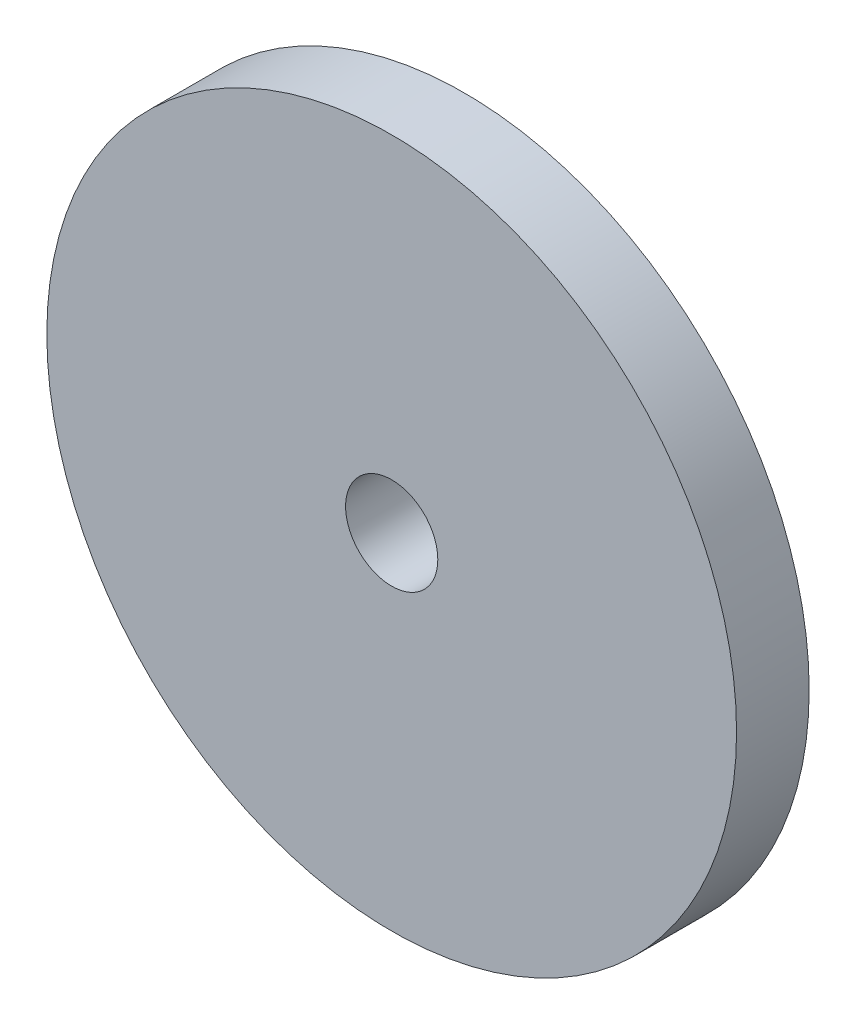
ISO-10303-21;
HEADER;
FILE_DESCRIPTION(('STEP AP214'),'2;1');
FILE_NAME('part.step','',(''),(''),'','','');
FILE_SCHEMA(('AUTOMOTIVE_DESIGN { 1 0 10303 214 1 1 1 1 }'));
ENDSEC;
DATA;
#1=APPLICATION_CONTEXT('core data for automotive mechanical design processes');
#2=APPLICATION_PROTOCOL_DEFINITION('international standard','automotive_design',2000,#1);
#3=PRODUCT_CONTEXT('',#1,'mechanical');
#4=PRODUCT('Part','Part','',(#3));
#5=PRODUCT_RELATED_PRODUCT_CATEGORY('part','',(#4));
#6=PRODUCT_DEFINITION_FORMATION('','',#4);
#7=PRODUCT_DEFINITION_CONTEXT('part definition',#1,'design');
#8=PRODUCT_DEFINITION('design','',#6,#7);
#9=PRODUCT_DEFINITION_SHAPE('','',#8);
#10=(LENGTH_UNIT() NAMED_UNIT(*) SI_UNIT(.MILLI.,.METRE.));
#11=(NAMED_UNIT(*) PLANE_ANGLE_UNIT() SI_UNIT($,.RADIAN.));
#12=(NAMED_UNIT(*) SI_UNIT($,.STERADIAN.) SOLID_ANGLE_UNIT());
#13=UNCERTAINTY_MEASURE_WITH_UNIT(LENGTH_MEASURE(1.E-05),#10,'distance_accuracy_value','');
#14=(GEOMETRIC_REPRESENTATION_CONTEXT(3) GLOBAL_UNCERTAINTY_ASSIGNED_CONTEXT((#13)) GLOBAL_UNIT_ASSIGNED_CONTEXT((#10,
#11,#12)) REPRESENTATION_CONTEXT('',''));
#15=CARTESIAN_POINT('',(0.,0.,0.));
#16=DIRECTION('',(0.,0.,1.));
#17=DIRECTION('',(1.,0.,0.));
#18=AXIS2_PLACEMENT_3D('',#15,#16,#17);
#19=CARTESIAN_POINT('',(0.,0.,10.));
#20=DIRECTION('',(0.,0.,1.));
#21=DIRECTION('',(1.,0.,0.));
#22=AXIS2_PLACEMENT_3D('',#19,#20,#21);
#23=PLANE('',#22);
#24=CARTESIAN_POINT('',(0.,0.,10.));
#25=DIRECTION('',(0.,0.,1.));
#26=DIRECTION('',(1.,0.,0.));
#27=AXIS2_PLACEMENT_3D('',#24,#25,#26);
#28=CIRCLE('',#27,47.5);
#29=CARTESIAN_POINT('',(47.5,0.,10.));
#30=VERTEX_POINT('',#29);
#31=EDGE_CURVE('E10',#30,#30,#28,.T.);
#32=ORIENTED_EDGE('',*,*,#31,.T.);
#33=EDGE_LOOP('',(#32));
#34=FACE_BOUND('',#33,.T.);
#35=CARTESIAN_POINT('',(0.,0.,10.));
#36=DIRECTION('',(0.,0.,1.));
#37=DIRECTION('',(1.,0.,0.));
#38=AXIS2_PLACEMENT_3D('',#35,#36,#37);
#39=CIRCLE('',#38,6.35);
#40=CARTESIAN_POINT('',(6.35,0.,10.));
#41=VERTEX_POINT('',#40);
#42=EDGE_CURVE('E45',#41,#41,#39,.T.);
#43=ORIENTED_EDGE('',*,*,#42,.F.);
#44=EDGE_LOOP('',(#43));
#45=FACE_BOUND('',#44,.T.);
#46=ADVANCED_FACE('F34',(#34,#45),#23,.T.);
#47=CARTESIAN_POINT('',(0.,0.,0.));
#48=DIRECTION('',(0.,0.,1.));
#49=DIRECTION('',(1.,0.,0.));
#50=AXIS2_PLACEMENT_3D('',#47,#48,#49);
#51=PLANE('',#50);
#52=CARTESIAN_POINT('',(0.,0.,0.));
#53=DIRECTION('',(0.,0.,1.));
#54=DIRECTION('',(1.,0.,0.));
#55=AXIS2_PLACEMENT_3D('',#52,#53,#54);
#56=CIRCLE('',#55,47.5);
#57=CARTESIAN_POINT('',(47.5,0.,0.));
#58=VERTEX_POINT('',#57);
#59=EDGE_CURVE('E38',#58,#58,#56,.T.);
#60=ORIENTED_EDGE('',*,*,#59,.F.);
#61=EDGE_LOOP('',(#60));
#62=FACE_BOUND('',#61,.T.);
#63=CARTESIAN_POINT('',(0.,0.,0.));
#64=DIRECTION('',(0.,0.,1.));
#65=DIRECTION('',(1.,0.,0.));
#66=AXIS2_PLACEMENT_3D('',#63,#64,#65);
#67=CIRCLE('',#66,6.35);
#68=CARTESIAN_POINT('',(6.35,0.,0.));
#69=VERTEX_POINT('',#68);
#70=EDGE_CURVE('E47',#69,#69,#67,.T.);
#71=ORIENTED_EDGE('',*,*,#70,.T.);
#72=EDGE_LOOP('',(#71));
#73=FACE_BOUND('',#72,.T.);
#74=ADVANCED_FACE('F57',(#62,#73),#51,.F.);
#75=CARTESIAN_POINT('',(0.,0.,10.));
#76=DIRECTION('',(0.,0.,-1.));
#77=DIRECTION('',(-1.,0.,0.));
#78=AXIS2_PLACEMENT_3D('',#75,#76,#77);
#79=CYLINDRICAL_SURFACE('',#78,47.5);
#80=ORIENTED_EDGE('',*,*,#31,.F.);
#81=EDGE_LOOP('',(#80));
#82=FACE_BOUND('',#81,.T.);
#83=ORIENTED_EDGE('',*,*,#59,.T.);
#84=EDGE_LOOP('',(#83));
#85=FACE_BOUND('',#84,.T.);
#86=ADVANCED_FACE('F36',(#82,#85),#79,.T.);
#87=CARTESIAN_POINT('',(0.,0.,10.));
#88=DIRECTION('',(0.,0.,-1.));
#89=DIRECTION('',(-1.,0.,0.));
#90=AXIS2_PLACEMENT_3D('',#87,#88,#89);
#91=CYLINDRICAL_SURFACE('',#90,6.35);
#92=ORIENTED_EDGE('',*,*,#42,.T.);
#93=EDGE_LOOP('',(#92));
#94=FACE_BOUND('',#93,.T.);
#95=ORIENTED_EDGE('',*,*,#70,.F.);
#96=EDGE_LOOP('',(#95));
#97=FACE_BOUND('',#96,.T.);
#98=ADVANCED_FACE('F53',(#94,#97),#91,.F.);
#99=CLOSED_SHELL('',(#46,#74,#86,#98));
#100=MANIFOLD_SOLID_BREP('B2',#99);
#101=ADVANCED_BREP_SHAPE_REPRESENTATION('',(#18,#100),#14);
#102=SHAPE_DEFINITION_REPRESENTATION(#9,#101);
ENDSEC;
END-ISO-10303-21;
